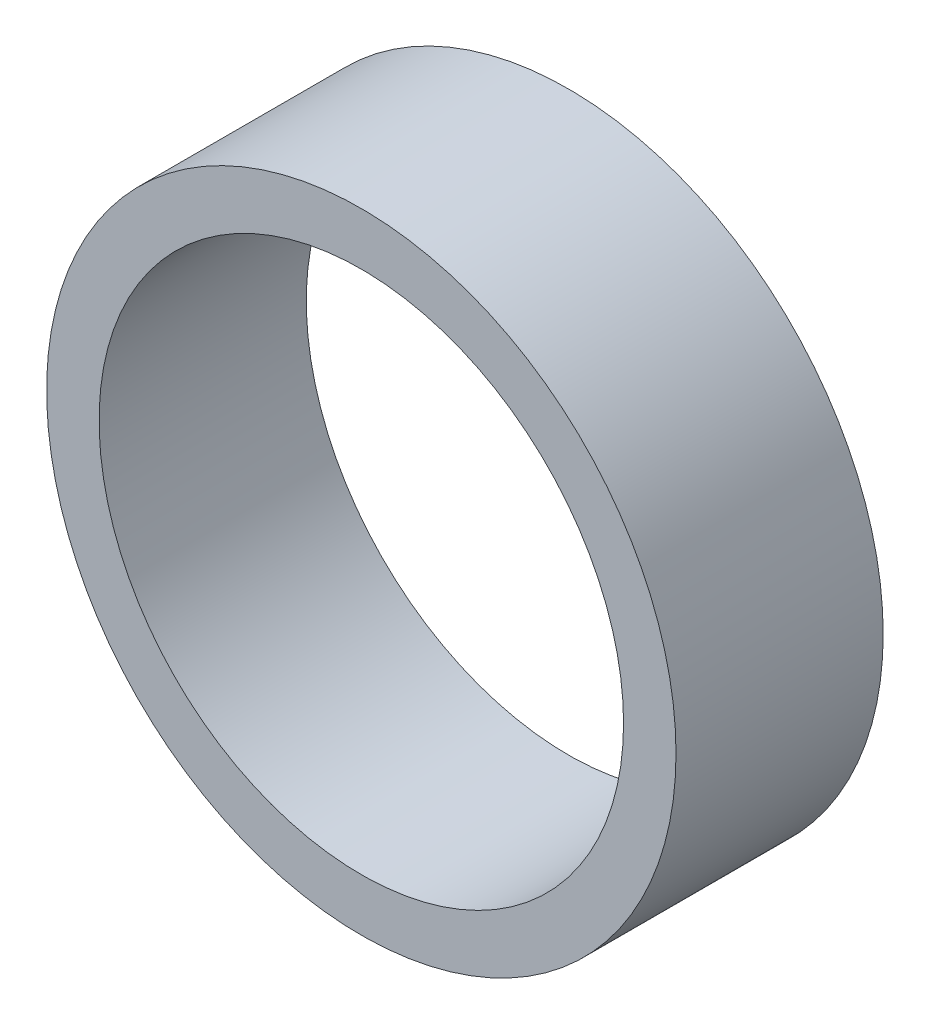
ISO-10303-21;
HEADER;
FILE_DESCRIPTION(('STEP AP214'),'2;1');
FILE_NAME('part.step','',(''),(''),'','','');
FILE_SCHEMA(('AUTOMOTIVE_DESIGN { 1 0 10303 214 1 1 1 1 }'));
ENDSEC;
DATA;
#1=APPLICATION_CONTEXT('core data for automotive mechanical design processes');
#2=APPLICATION_PROTOCOL_DEFINITION('international standard','automotive_design',2000,#1);
#3=PRODUCT_CONTEXT('',#1,'mechanical');
#4=PRODUCT('Part','Part','',(#3));
#5=PRODUCT_RELATED_PRODUCT_CATEGORY('part','',(#4));
#6=PRODUCT_DEFINITION_FORMATION('','',#4);
#7=PRODUCT_DEFINITION_CONTEXT('part definition',#1,'design');
#8=PRODUCT_DEFINITION('design','',#6,#7);
#9=PRODUCT_DEFINITION_SHAPE('','',#8);
#10=(LENGTH_UNIT() NAMED_UNIT(*) SI_UNIT(.MILLI.,.METRE.));
#11=(NAMED_UNIT(*) PLANE_ANGLE_UNIT() SI_UNIT($,.RADIAN.));
#12=(NAMED_UNIT(*) SI_UNIT($,.STERADIAN.) SOLID_ANGLE_UNIT());
#13=UNCERTAINTY_MEASURE_WITH_UNIT(LENGTH_MEASURE(1.E-05),#10,'distance_accuracy_value','');
#14=(GEOMETRIC_REPRESENTATION_CONTEXT(3) GLOBAL_UNCERTAINTY_ASSIGNED_CONTEXT((#13)) GLOBAL_UNIT_ASSIGNED_CONTEXT((#10,
#11,#12)) REPRESENTATION_CONTEXT('',''));
#15=CARTESIAN_POINT('',(0.,0.,0.));
#16=DIRECTION('',(0.,0.,1.));
#17=DIRECTION('',(1.,0.,0.));
#18=AXIS2_PLACEMENT_3D('',#15,#16,#17);
#19=CARTESIAN_POINT('',(0.,0.,15.8));
#20=DIRECTION('',(0.,0.,1.));
#21=DIRECTION('',(1.,0.,0.));
#22=AXIS2_PLACEMENT_3D('',#19,#20,#21);
#23=PLANE('',#22);
#24=CARTESIAN_POINT('',(0.,0.,15.8));
#25=DIRECTION('',(0.,0.,1.));
#26=DIRECTION('',(1.,0.,0.));
#27=AXIS2_PLACEMENT_3D('',#24,#25,#26);
#28=CIRCLE('',#27,24.);
#29=CARTESIAN_POINT('',(24.,0.,15.8));
#30=VERTEX_POINT('',#29);
#31=EDGE_CURVE('E10',#30,#30,#28,.T.);
#32=ORIENTED_EDGE('',*,*,#31,.T.);
#33=EDGE_LOOP('',(#32));
#34=FACE_BOUND('',#33,.T.);
#35=CARTESIAN_POINT('',(0.,0.,15.8));
#36=DIRECTION('',(0.,0.,1.));
#37=DIRECTION('',(1.,0.,0.));
#38=AXIS2_PLACEMENT_3D('',#35,#36,#37);
#39=CIRCLE('',#38,20.);
#40=CARTESIAN_POINT('',(20.,0.,15.8));
#41=VERTEX_POINT('',#40);
#42=EDGE_CURVE('E50',#41,#41,#39,.T.);
#43=ORIENTED_EDGE('',*,*,#42,.F.);
#44=EDGE_LOOP('',(#43));
#45=FACE_BOUND('',#44,.T.);
#46=ADVANCED_FACE('F37',(#34,#45),#23,.T.);
#47=CARTESIAN_POINT('',(0.,0.,0.));
#48=DIRECTION('',(0.,0.,1.));
#49=DIRECTION('',(1.,0.,0.));
#50=AXIS2_PLACEMENT_3D('',#47,#48,#49);
#51=PLANE('',#50);
#52=CARTESIAN_POINT('',(0.,0.,0.));
#53=DIRECTION('',(0.,0.,1.));
#54=DIRECTION('',(1.,0.,0.));
#55=AXIS2_PLACEMENT_3D('',#52,#53,#54);
#56=CIRCLE('',#55,24.);
#57=CARTESIAN_POINT('',(24.,0.,0.));
#58=VERTEX_POINT('',#57);
#59=EDGE_CURVE('E41',#58,#58,#56,.T.);
#60=ORIENTED_EDGE('',*,*,#59,.F.);
#61=EDGE_LOOP('',(#60));
#62=FACE_BOUND('',#61,.T.);
#63=CARTESIAN_POINT('',(0.,0.,0.));
#64=DIRECTION('',(0.,0.,1.));
#65=DIRECTION('',(1.,0.,0.));
#66=AXIS2_PLACEMENT_3D('',#63,#64,#65);
#67=CIRCLE('',#66,20.);
#68=CARTESIAN_POINT('',(20.,0.,0.));
#69=VERTEX_POINT('',#68);
#70=EDGE_CURVE('E52',#69,#69,#67,.T.);
#71=ORIENTED_EDGE('',*,*,#70,.T.);
#72=EDGE_LOOP('',(#71));
#73=FACE_BOUND('',#72,.T.);
#74=ADVANCED_FACE('F64',(#62,#73),#51,.F.);
#75=CARTESIAN_POINT('',(0.,0.,15.8));
#76=DIRECTION('',(0.,0.,-1.));
#77=DIRECTION('',(-1.,0.,0.));
#78=AXIS2_PLACEMENT_3D('',#75,#76,#77);
#79=CYLINDRICAL_SURFACE('',#78,24.);
#80=ORIENTED_EDGE('',*,*,#31,.F.);
#81=EDGE_LOOP('',(#80));
#82=FACE_BOUND('',#81,.T.);
#83=ORIENTED_EDGE('',*,*,#59,.T.);
#84=EDGE_LOOP('',(#83));
#85=FACE_BOUND('',#84,.T.);
#86=ADVANCED_FACE('F39',(#82,#85),#79,.T.);
#87=CARTESIAN_POINT('',(0.,0.,15.8));
#88=DIRECTION('',(0.,0.,-1.));
#89=DIRECTION('',(-1.,0.,0.));
#90=AXIS2_PLACEMENT_3D('',#87,#88,#89);
#91=CYLINDRICAL_SURFACE('',#90,20.);
#92=ORIENTED_EDGE('',*,*,#42,.T.);
#93=EDGE_LOOP('',(#92));
#94=FACE_BOUND('',#93,.T.);
#95=ORIENTED_EDGE('',*,*,#70,.F.);
#96=EDGE_LOOP('',(#95));
#97=FACE_BOUND('',#96,.T.);
#98=ADVANCED_FACE('F60',(#94,#97),#91,.F.);
#99=CLOSED_SHELL('',(#46,#74,#86,#98));
#100=MANIFOLD_SOLID_BREP('B2',#99);
#101=ADVANCED_BREP_SHAPE_REPRESENTATION('',(#18,#100),#14);
#102=SHAPE_DEFINITION_REPRESENTATION(#9,#101);
ENDSEC;
END-ISO-10303-21;
